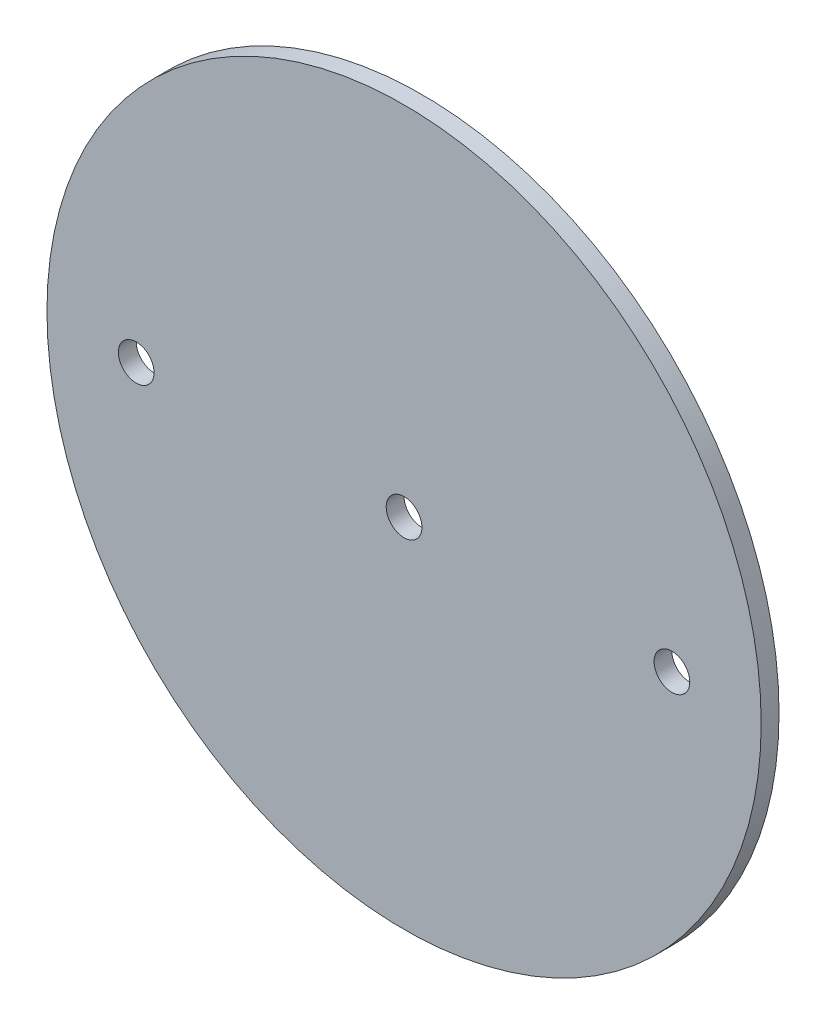
ISO-10303-21;
HEADER;
FILE_DESCRIPTION(('STEP AP214'),'2;1');
FILE_NAME('part.step','',(''),(''),'','','');
FILE_SCHEMA(('AUTOMOTIVE_DESIGN { 1 0 10303 214 1 1 1 1 }'));
ENDSEC;
DATA;
#1=APPLICATION_CONTEXT('core data for automotive mechanical design processes');
#2=APPLICATION_PROTOCOL_DEFINITION('international standard','automotive_design',2000,#1);
#3=PRODUCT_CONTEXT('',#1,'mechanical');
#4=PRODUCT('Part','Part','',(#3));
#5=PRODUCT_RELATED_PRODUCT_CATEGORY('part','',(#4));
#6=PRODUCT_DEFINITION_FORMATION('','',#4);
#7=PRODUCT_DEFINITION_CONTEXT('part definition',#1,'design');
#8=PRODUCT_DEFINITION('design','',#6,#7);
#9=PRODUCT_DEFINITION_SHAPE('','',#8);
#10=(LENGTH_UNIT() NAMED_UNIT(*) SI_UNIT(.MILLI.,.METRE.));
#11=(NAMED_UNIT(*) PLANE_ANGLE_UNIT() SI_UNIT($,.RADIAN.));
#12=(NAMED_UNIT(*) SI_UNIT($,.STERADIAN.) SOLID_ANGLE_UNIT());
#13=UNCERTAINTY_MEASURE_WITH_UNIT(LENGTH_MEASURE(1.E-05),#10,'distance_accuracy_value','');
#14=(GEOMETRIC_REPRESENTATION_CONTEXT(3) GLOBAL_UNCERTAINTY_ASSIGNED_CONTEXT((#13)) GLOBAL_UNIT_ASSIGNED_CONTEXT((#10,
#11,#12)) REPRESENTATION_CONTEXT('',''));
#15=CARTESIAN_POINT('',(0.,0.,0.));
#16=DIRECTION('',(0.,0.,1.));
#17=DIRECTION('',(1.,0.,0.));
#18=AXIS2_PLACEMENT_3D('',#15,#16,#17);
#19=CARTESIAN_POINT('',(0.,0.,1.5875));
#20=DIRECTION('',(0.,0.,-1.));
#21=DIRECTION('',(-1.,0.,0.));
#22=AXIS2_PLACEMENT_3D('',#19,#20,#21);
#23=CYLINDRICAL_SURFACE('',#22,63.5);
#24=CARTESIAN_POINT('',(0.,0.,1.5875));
#25=DIRECTION('',(0.,0.,1.));
#26=DIRECTION('',(1.,0.,0.));
#27=AXIS2_PLACEMENT_3D('',#24,#25,#26);
#28=CIRCLE('',#27,63.5);
#29=CARTESIAN_POINT('',(63.5,0.,1.5875));
#30=VERTEX_POINT('',#29);
#31=EDGE_CURVE('E10',#30,#30,#28,.T.);
#32=ORIENTED_EDGE('',*,*,#31,.F.);
#33=EDGE_LOOP('',(#32));
#34=FACE_BOUND('',#33,.T.);
#35=CARTESIAN_POINT('',(0.,0.,-1.5875));
#36=DIRECTION('',(0.,0.,1.));
#37=DIRECTION('',(1.,0.,0.));
#38=AXIS2_PLACEMENT_3D('',#35,#36,#37);
#39=CIRCLE('',#38,63.5);
#40=CARTESIAN_POINT('',(63.5,0.,-1.5875));
#41=VERTEX_POINT('',#40);
#42=EDGE_CURVE('E40',#41,#41,#39,.T.);
#43=ORIENTED_EDGE('',*,*,#42,.T.);
#44=EDGE_LOOP('',(#43));
#45=FACE_BOUND('',#44,.T.);
#46=ADVANCED_FACE('F37',(#34,#45),#23,.T.);
#47=CARTESIAN_POINT('',(0.,0.,1.5875));
#48=DIRECTION('',(0.,0.,1.));
#49=DIRECTION('',(1.,0.,0.));
#50=AXIS2_PLACEMENT_3D('',#47,#48,#49);
#51=PLANE('',#50);
#52=CARTESIAN_POINT('',(0.,0.,1.5875));
#53=DIRECTION('',(0.,0.,1.));
#54=DIRECTION('',(1.,0.,0.));
#55=AXIS2_PLACEMENT_3D('',#52,#53,#54);
#56=CIRCLE('',#55,3.17499999999999);
#57=CARTESIAN_POINT('',(3.17499999999999,0.,1.5875));
#58=VERTEX_POINT('',#57);
#59=EDGE_CURVE('E63',#58,#58,#56,.T.);
#60=ORIENTED_EDGE('',*,*,#59,.F.);
#61=EDGE_LOOP('',(#60));
#62=FACE_BOUND('',#61,.T.);
#63=CARTESIAN_POINT('',(47.625,0.,1.5875));
#64=DIRECTION('',(0.,0.,1.));
#65=DIRECTION('',(1.,0.,0.));
#66=AXIS2_PLACEMENT_3D('',#63,#64,#65);
#67=CIRCLE('',#66,3.17499999999998);
#68=CARTESIAN_POINT('',(50.8,0.,1.5875));
#69=VERTEX_POINT('',#68);
#70=EDGE_CURVE('E57',#69,#69,#67,.T.);
#71=ORIENTED_EDGE('',*,*,#70,.F.);
#72=EDGE_LOOP('',(#71));
#73=FACE_BOUND('',#72,.T.);
#74=CARTESIAN_POINT('',(-47.625,0.,1.5875));
#75=DIRECTION('',(0.,0.,1.));
#76=DIRECTION('',(1.,0.,0.));
#77=AXIS2_PLACEMENT_3D('',#74,#75,#76);
#78=CIRCLE('',#77,3.17499999999998);
#79=CARTESIAN_POINT('',(-44.45,0.,1.5875));
#80=VERTEX_POINT('',#79);
#81=EDGE_CURVE('E51',#80,#80,#78,.T.);
#82=ORIENTED_EDGE('',*,*,#81,.F.);
#83=EDGE_LOOP('',(#82));
#84=FACE_BOUND('',#83,.T.);
#85=ORIENTED_EDGE('',*,*,#31,.T.);
#86=EDGE_LOOP('',(#85));
#87=FACE_BOUND('',#86,.T.);
#88=ADVANCED_FACE('F69',(#62,#73,#84,#87),#51,.T.);
#89=CARTESIAN_POINT('',(0.,0.,-1.5875));
#90=DIRECTION('',(0.,0.,1.));
#91=DIRECTION('',(1.,0.,0.));
#92=AXIS2_PLACEMENT_3D('',#89,#90,#91);
#93=PLANE('',#92);
#94=CARTESIAN_POINT('',(0.,0.,-1.5875));
#95=DIRECTION('',(0.,0.,1.));
#96=DIRECTION('',(1.,0.,0.));
#97=AXIS2_PLACEMENT_3D('',#94,#95,#96);
#98=CIRCLE('',#97,3.17499999999999);
#99=CARTESIAN_POINT('',(3.17499999999999,0.,-1.5875));
#100=VERTEX_POINT('',#99);
#101=EDGE_CURVE('E60',#100,#100,#98,.T.);
#102=ORIENTED_EDGE('',*,*,#101,.T.);
#103=EDGE_LOOP('',(#102));
#104=FACE_BOUND('',#103,.T.);
#105=CARTESIAN_POINT('',(47.625,0.,-1.5875));
#106=DIRECTION('',(0.,0.,1.));
#107=DIRECTION('',(1.,0.,0.));
#108=AXIS2_PLACEMENT_3D('',#105,#106,#107);
#109=CIRCLE('',#108,3.17499999999999);
#110=CARTESIAN_POINT('',(50.8,0.,-1.5875));
#111=VERTEX_POINT('',#110);
#112=EDGE_CURVE('E54',#111,#111,#109,.T.);
#113=ORIENTED_EDGE('',*,*,#112,.T.);
#114=EDGE_LOOP('',(#113));
#115=FACE_BOUND('',#114,.T.);
#116=CARTESIAN_POINT('',(-47.625,0.,-1.5875));
#117=DIRECTION('',(0.,0.,1.));
#118=DIRECTION('',(1.,0.,0.));
#119=AXIS2_PLACEMENT_3D('',#116,#117,#118);
#120=CIRCLE('',#119,3.17499999999999);
#121=CARTESIAN_POINT('',(-44.45,0.,-1.5875));
#122=VERTEX_POINT('',#121);
#123=EDGE_CURVE('E47',#122,#122,#120,.T.);
#124=ORIENTED_EDGE('',*,*,#123,.T.);
#125=EDGE_LOOP('',(#124));
#126=FACE_BOUND('',#125,.T.);
#127=ORIENTED_EDGE('',*,*,#42,.F.);
#128=EDGE_LOOP('',(#127));
#129=FACE_BOUND('',#128,.T.);
#130=ADVANCED_FACE('F72',(#104,#115,#126,#129),#93,.F.);
#131=CARTESIAN_POINT('',(-47.625,0.,1.5875));
#132=DIRECTION('',(0.,0.,1.));
#133=DIRECTION('',(1.,0.,0.));
#134=AXIS2_PLACEMENT_3D('',#131,#132,#133);
#135=CYLINDRICAL_SURFACE('',#134,3.17499999999999);
#136=ORIENTED_EDGE('',*,*,#123,.F.);
#137=EDGE_LOOP('',(#136));
#138=FACE_BOUND('',#137,.T.);
#139=ORIENTED_EDGE('',*,*,#81,.T.);
#140=EDGE_LOOP('',(#139));
#141=FACE_BOUND('',#140,.T.);
#142=ADVANCED_FACE('F78',(#138,#141),#135,.F.);
#143=CARTESIAN_POINT('',(47.625,0.,1.5875));
#144=DIRECTION('',(0.,0.,1.));
#145=DIRECTION('',(1.,0.,0.));
#146=AXIS2_PLACEMENT_3D('',#143,#144,#145);
#147=CYLINDRICAL_SURFACE('',#146,3.17499999999999);
#148=ORIENTED_EDGE('',*,*,#112,.F.);
#149=EDGE_LOOP('',(#148));
#150=FACE_BOUND('',#149,.T.);
#151=ORIENTED_EDGE('',*,*,#70,.T.);
#152=EDGE_LOOP('',(#151));
#153=FACE_BOUND('',#152,.T.);
#154=ADVANCED_FACE('F80',(#150,#153),#147,.F.);
#155=CARTESIAN_POINT('',(0.,0.,1.5875));
#156=DIRECTION('',(0.,0.,1.));
#157=DIRECTION('',(1.,0.,0.));
#158=AXIS2_PLACEMENT_3D('',#155,#156,#157);
#159=CYLINDRICAL_SURFACE('',#158,3.17499999999999);
#160=ORIENTED_EDGE('',*,*,#101,.F.);
#161=EDGE_LOOP('',(#160));
#162=FACE_BOUND('',#161,.T.);
#163=ORIENTED_EDGE('',*,*,#59,.T.);
#164=EDGE_LOOP('',(#163));
#165=FACE_BOUND('',#164,.T.);
#166=ADVANCED_FACE('F67',(#162,#165),#159,.F.);
#167=CLOSED_SHELL('',(#46,#88,#130,#142,#154,#166));
#168=MANIFOLD_SOLID_BREP('B2',#167);
#169=ADVANCED_BREP_SHAPE_REPRESENTATION('',(#18,#168),#14);
#170=SHAPE_DEFINITION_REPRESENTATION(#9,#169);
ENDSEC;
END-ISO-10303-21;
